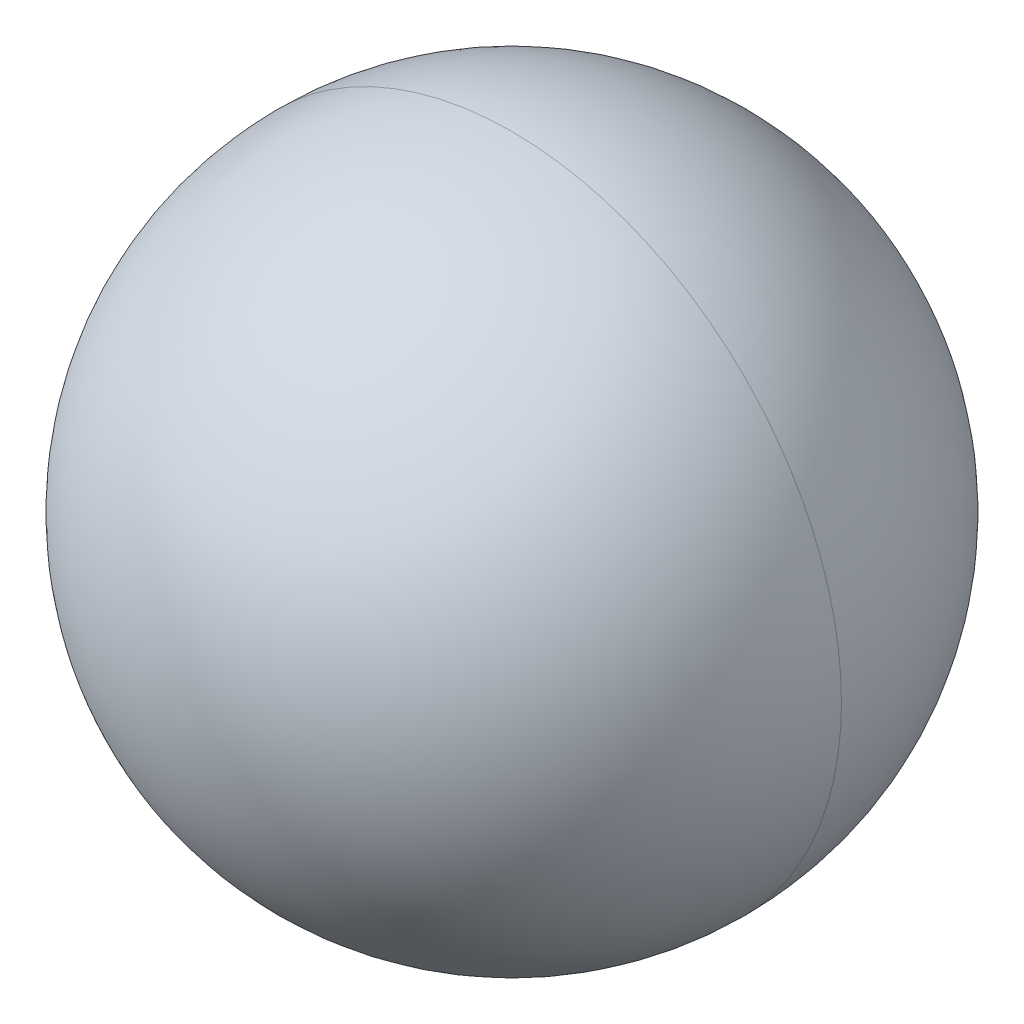
ISO-10303-21;
HEADER;
FILE_DESCRIPTION(('STEP AP214'),'2;1');
FILE_NAME('part.step','',(''),(''),'','','');
FILE_SCHEMA(('AUTOMOTIVE_DESIGN { 1 0 10303 214 1 1 1 1 }'));
ENDSEC;
DATA;
#1=APPLICATION_CONTEXT('core data for automotive mechanical design processes');
#2=APPLICATION_PROTOCOL_DEFINITION('international standard','automotive_design',2000,#1);
#3=PRODUCT_CONTEXT('',#1,'mechanical');
#4=PRODUCT('Part','Part','',(#3));
#5=PRODUCT_RELATED_PRODUCT_CATEGORY('part','',(#4));
#6=PRODUCT_DEFINITION_FORMATION('','',#4);
#7=PRODUCT_DEFINITION_CONTEXT('part definition',#1,'design');
#8=PRODUCT_DEFINITION('design','',#6,#7);
#9=PRODUCT_DEFINITION_SHAPE('','',#8);
#10=(LENGTH_UNIT() NAMED_UNIT(*) SI_UNIT(.MILLI.,.METRE.));
#11=(NAMED_UNIT(*) PLANE_ANGLE_UNIT() SI_UNIT($,.RADIAN.));
#12=(NAMED_UNIT(*) SI_UNIT($,.STERADIAN.) SOLID_ANGLE_UNIT());
#13=UNCERTAINTY_MEASURE_WITH_UNIT(LENGTH_MEASURE(1.E-05),#10,'distance_accuracy_value','');
#14=(GEOMETRIC_REPRESENTATION_CONTEXT(3) GLOBAL_UNCERTAINTY_ASSIGNED_CONTEXT((#13)) GLOBAL_UNIT_ASSIGNED_CONTEXT((#10,
#11,#12)) REPRESENTATION_CONTEXT('',''));
#15=CARTESIAN_POINT('',(0.,0.,0.));
#16=DIRECTION('',(0.,0.,1.));
#17=DIRECTION('',(1.,0.,0.));
#18=AXIS2_PLACEMENT_3D('',#15,#16,#17);
#19=CARTESIAN_POINT('',(0.2,0.2,0.135));
#20=DIRECTION('',(0.,0.,-1.));
#21=DIRECTION('',(1.,0.,0.));
#22=AXIS2_PLACEMENT_3D('',#19,#20,#21);
#23=SPHERICAL_SURFACE('',#22,0.135);
#24=CARTESIAN_POINT('',(0.2,0.2,0.135));
#25=DIRECTION('',(0.,0.,1.));
#26=DIRECTION('',(1.,0.,0.));
#27=AXIS2_PLACEMENT_3D('',#24,#25,#26);
#28=CIRCLE('',#27,0.135);
#29=CARTESIAN_POINT('',(0.335,0.2,0.135));
#30=VERTEX_POINT('',#29);
#31=CARTESIAN_POINT('',(0.2,0.335,0.135));
#32=VERTEX_POINT('',#31);
#33=EDGE_CURVE('E11',#30,#32,#28,.T.);
#34=ORIENTED_EDGE('',*,*,#33,.F.);
#35=CARTESIAN_POINT('',(0.335,0.2,0.135));
#36=CARTESIAN_POINT('',(0.334999999999999,0.2,0.0925884991765377));
#37=CARTESIAN_POINT('',(0.318392974453827,0.2,0.0501374281460087));
#38=CARTESIAN_POINT('',(0.284862571853991,0.2,0.0166070255461743));
#39=CARTESIAN_POINT('',(0.242411500823463,0.2,0.));
#40=CARTESIAN_POINT('',(0.2,0.2,0.));
#41=B_SPLINE_CURVE_WITH_KNOTS('',5,(#35,#36,#37,#38,#39,#40),.UNSPECIFIED.,.F.,.F.,(6,6),(0.,
1.5707963267949),.UNSPECIFIED.);
#42=CARTESIAN_POINT('',(0.2,0.2,0.));
#43=VERTEX_POINT('',#42);
#44=EDGE_CURVE('E24',#30,#43,#41,.T.);
#45=ORIENTED_EDGE('',*,*,#44,.T.);
#46=ORIENTED_EDGE('',*,*,#44,.F.);
#47=CARTESIAN_POINT('',(0.2,0.065,0.135));
#48=VERTEX_POINT('',#47);
#49=EDGE_CURVE('E25',#48,#30,#28,.T.);
#50=ORIENTED_EDGE('',*,*,#49,.F.);
#51=CARTESIAN_POINT('',(0.2,0.2,0.135));
#52=DIRECTION('',(0.,0.,-1.));
#53=DIRECTION('',(-1.,0.,0.));
#54=AXIS2_PLACEMENT_3D('',#51,#52,#53);
#55=CIRCLE('',#54,0.135);
#56=EDGE_CURVE('E46',#48,#32,#55,.T.);
#57=ORIENTED_EDGE('',*,*,#56,.T.);
#58=EDGE_LOOP('',(#34,#45,#46,#50,#57));
#59=FACE_BOUND('',#58,.T.);
#60=ADVANCED_FACE('F17',(#59),#23,.T.);
#61=CARTESIAN_POINT('',(0.2,0.2,0.135));
#62=DIRECTION('',(0.,0.,-1.));
#63=DIRECTION('',(1.,0.,0.));
#64=AXIS2_PLACEMENT_3D('',#61,#62,#63);
#65=SPHERICAL_SURFACE('',#64,0.135);
#66=ORIENTED_EDGE('',*,*,#56,.F.);
#67=ORIENTED_EDGE('',*,*,#49,.T.);
#68=CARTESIAN_POINT('',(0.2,0.2,0.27));
#69=CARTESIAN_POINT('',(0.242411500823462,0.2,0.27));
#70=CARTESIAN_POINT('',(0.284862571853992,0.2,0.253392974453826));
#71=CARTESIAN_POINT('',(0.318392974453825,0.2,0.219862571853991));
#72=CARTESIAN_POINT('',(0.335,0.2,0.177411500823462));
#73=CARTESIAN_POINT('',(0.335,0.2,0.135));
#74=B_SPLINE_CURVE_WITH_KNOTS('',5,(#68,#69,#70,#71,#72,#73),.UNSPECIFIED.,.F.,.F.,(6,6),
(-1.5707963267949,0.),.UNSPECIFIED.);
#75=CARTESIAN_POINT('',(0.2,0.2,0.27));
#76=VERTEX_POINT('',#75);
#77=EDGE_CURVE('E44',#76,#30,#74,.T.);
#78=ORIENTED_EDGE('',*,*,#77,.F.);
#79=ORIENTED_EDGE('',*,*,#77,.T.);
#80=ORIENTED_EDGE('',*,*,#33,.T.);
#81=EDGE_LOOP('',(#66,#67,#78,#79,#80));
#82=FACE_BOUND('',#81,.T.);
#83=ADVANCED_FACE('F45',(#82),#65,.T.);
#84=CLOSED_SHELL('',(#60,#83));
#85=MANIFOLD_SOLID_BREP('B1',#84);
#86=ADVANCED_BREP_SHAPE_REPRESENTATION('',(#18,#85),#14);
#87=SHAPE_DEFINITION_REPRESENTATION(#9,#86);
ENDSEC;
END-ISO-10303-21;
